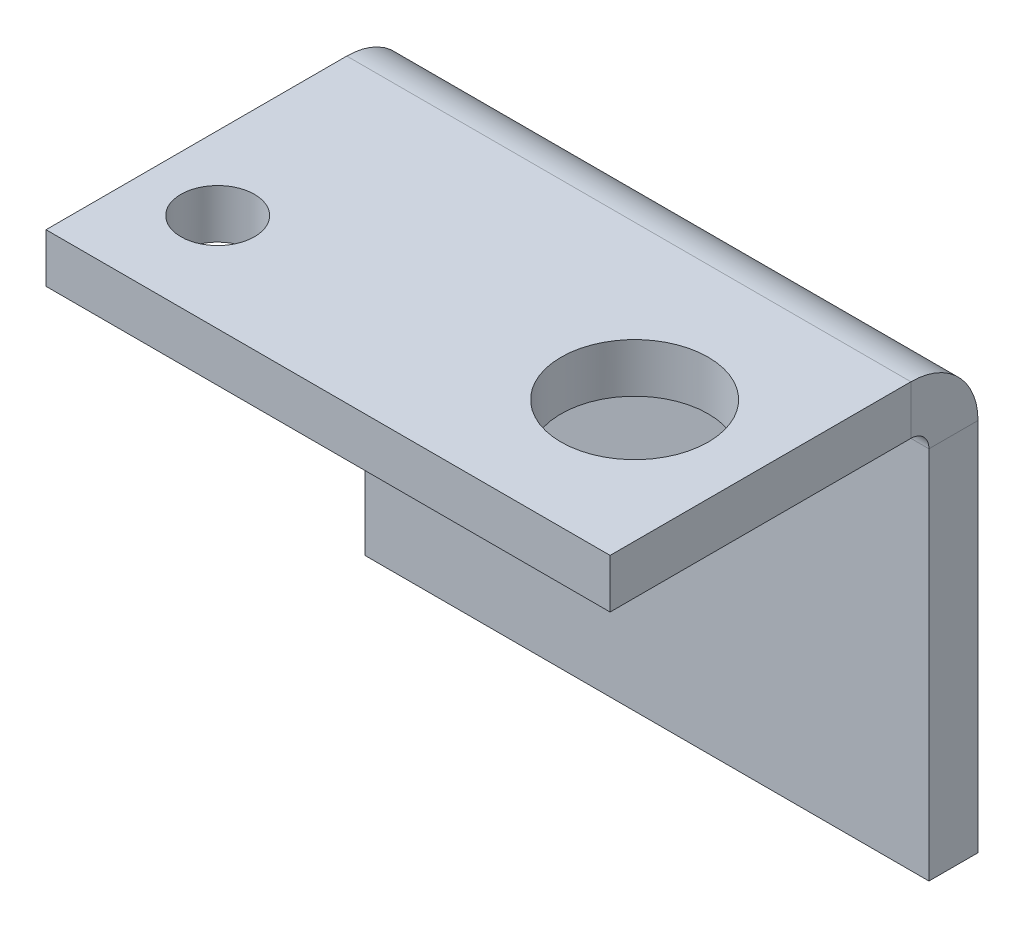
ISO-10303-21;
HEADER;
FILE_DESCRIPTION(('STEP AP214'),'2;1');
FILE_NAME('part.step','',(''),(''),'','','');
FILE_SCHEMA(('AUTOMOTIVE_DESIGN { 1 0 10303 214 1 1 1 1 }'));
ENDSEC;
DATA;
#1=APPLICATION_CONTEXT('core data for automotive mechanical design processes');
#2=APPLICATION_PROTOCOL_DEFINITION('international standard','automotive_design',2000,#1);
#3=PRODUCT_CONTEXT('',#1,'mechanical');
#4=PRODUCT('Part','Part','',(#3));
#5=PRODUCT_RELATED_PRODUCT_CATEGORY('part','',(#4));
#6=PRODUCT_DEFINITION_FORMATION('','',#4);
#7=PRODUCT_DEFINITION_CONTEXT('part definition',#1,'design');
#8=PRODUCT_DEFINITION('design','',#6,#7);
#9=PRODUCT_DEFINITION_SHAPE('','',#8);
#10=(LENGTH_UNIT() NAMED_UNIT(*) SI_UNIT(.MILLI.,.METRE.));
#11=(NAMED_UNIT(*) PLANE_ANGLE_UNIT() SI_UNIT($,.RADIAN.));
#12=(NAMED_UNIT(*) SI_UNIT($,.STERADIAN.) SOLID_ANGLE_UNIT());
#13=UNCERTAINTY_MEASURE_WITH_UNIT(LENGTH_MEASURE(1.E-05),#10,'distance_accuracy_value','');
#14=(GEOMETRIC_REPRESENTATION_CONTEXT(3) GLOBAL_UNCERTAINTY_ASSIGNED_CONTEXT((#13)) GLOBAL_UNIT_ASSIGNED_CONTEXT((#10,
#11,#12)) REPRESENTATION_CONTEXT('',''));
#15=CARTESIAN_POINT('',(0.,0.,0.));
#16=DIRECTION('',(0.,0.,1.));
#17=DIRECTION('',(1.,0.,0.));
#18=AXIS2_PLACEMENT_3D('',#15,#16,#17);
#19=CARTESIAN_POINT('',(25.,0.,0.));
#20=DIRECTION('',(1.,0.,0.));
#21=DIRECTION('',(0.,0.,-1.));
#22=AXIS2_PLACEMENT_3D('',#19,#20,#21);
#23=PLANE('',#22);
#24=DIRECTION('',(0.,1.,0.));
#25=VECTOR('',#24,1.);
#26=CARTESIAN_POINT('',(25.,0.,0.));
#27=LINE('',#26,#25);
#28=CARTESIAN_POINT('',(25.,-18.,0.));
#29=VERTEX_POINT('',#28);
#30=CARTESIAN_POINT('',(25.,-2.73659999999998,0.));
#31=VERTEX_POINT('',#30);
#32=EDGE_CURVE('E172',#29,#31,#27,.T.);
#33=ORIENTED_EDGE('',*,*,#32,.T.);
#34=DIRECTION('',(0.,0.,1.));
#35=VECTOR('',#34,1.);
#36=CARTESIAN_POINT('',(25.,-2.73659999999998,0.));
#37=LINE('',#36,#35);
#38=CARTESIAN_POINT('',(25.,-2.7366,2.));
#39=VERTEX_POINT('',#38);
#40=EDGE_CURVE('E13',#31,#39,#37,.T.);
#41=ORIENTED_EDGE('',*,*,#40,.T.);
#42=DIRECTION('',(0.,1.,0.));
#43=VECTOR('',#42,1.);
#44=CARTESIAN_POINT('',(25.,0.,2.00000000000001));
#45=LINE('',#44,#43);
#46=CARTESIAN_POINT('',(25.,-18.,1.99999999999994));
#47=VERTEX_POINT('',#46);
#48=EDGE_CURVE('E73',#47,#39,#45,.T.);
#49=ORIENTED_EDGE('',*,*,#48,.F.);
#50=DIRECTION('',(0.,0.,-1.));
#51=VECTOR('',#50,1.);
#52=CARTESIAN_POINT('',(25.,-18.,0.));
#53=LINE('',#52,#51);
#54=EDGE_CURVE('E170',#47,#29,#53,.T.);
#55=ORIENTED_EDGE('',*,*,#54,.T.);
#56=EDGE_LOOP('',(#33,#41,#49,#55));
#57=FACE_BOUND('',#56,.T.);
#58=ADVANCED_FACE('F59',(#57),#23,.T.);
#59=DIRECTION('',(0.,0.,-1.));
#60=VECTOR('',#59,1.);
#61=CARTESIAN_POINT('',(25.,-2.,15.));
#62=LINE('',#61,#60);
#63=CARTESIAN_POINT('',(25.,-2.,15.));
#64=VERTEX_POINT('',#63);
#65=CARTESIAN_POINT('',(25.,-2.,2.7366));
#66=VERTEX_POINT('',#65);
#67=EDGE_CURVE('E206',#64,#66,#62,.T.);
#68=ORIENTED_EDGE('',*,*,#67,.T.);
#69=DIRECTION('',(0.,1.,0.));
#70=VECTOR('',#69,1.);
#71=CARTESIAN_POINT('',(25.,-2.,2.7366));
#72=LINE('',#71,#70);
#73=CARTESIAN_POINT('',(25.,0.,2.7366));
#74=VERTEX_POINT('',#73);
#75=EDGE_CURVE('E67',#66,#74,#72,.T.);
#76=ORIENTED_EDGE('',*,*,#75,.T.);
#77=DIRECTION('',(0.,0.,1.));
#78=VECTOR('',#77,1.);
#79=CARTESIAN_POINT('',(25.,0.,15.));
#80=LINE('',#79,#78);
#81=CARTESIAN_POINT('',(25.,0.,15.));
#82=VERTEX_POINT('',#81);
#83=EDGE_CURVE('E124',#74,#82,#80,.T.);
#84=ORIENTED_EDGE('',*,*,#83,.T.);
#85=DIRECTION('',(0.,-1.,0.));
#86=VECTOR('',#85,1.);
#87=CARTESIAN_POINT('',(25.,0.,15.));
#88=LINE('',#87,#86);
#89=EDGE_CURVE('E128',#82,#64,#88,.T.);
#90=ORIENTED_EDGE('',*,*,#89,.T.);
#91=EDGE_LOOP('',(#68,#76,#84,#90));
#92=FACE_BOUND('',#91,.T.);
#93=ADVANCED_FACE('F127',(#92),#23,.T.);
#94=CARTESIAN_POINT('',(0.,-2.,15.));
#95=DIRECTION('',(0.,1.,0.));
#96=DIRECTION('',(0.,0.,1.));
#97=AXIS2_PLACEMENT_3D('',#94,#95,#96);
#98=PLANE('',#97);
#99=CARTESIAN_POINT('',(5.,-2.,11.));
#100=DIRECTION('',(0.,-1.,0.));
#101=DIRECTION('',(0.,0.,-1.));
#102=AXIS2_PLACEMENT_3D('',#99,#100,#101);
#103=CIRCLE('',#102,1.5);
#104=CARTESIAN_POINT('',(5.,-2.,9.5));
#105=VERTEX_POINT('',#104);
#106=EDGE_CURVE('E159',#105,#105,#103,.T.);
#107=ORIENTED_EDGE('',*,*,#106,.F.);
#108=EDGE_LOOP('',(#107));
#109=FACE_BOUND('',#108,.T.);
#110=CARTESIAN_POINT('',(20.,-2.,9.));
#111=DIRECTION('',(0.,-1.,0.));
#112=DIRECTION('',(0.,0.,-1.));
#113=AXIS2_PLACEMENT_3D('',#110,#111,#112);
#114=CIRCLE('',#113,3.);
#115=CARTESIAN_POINT('',(20.,-2.,6.));
#116=VERTEX_POINT('',#115);
#117=EDGE_CURVE('E163',#116,#116,#114,.T.);
#118=ORIENTED_EDGE('',*,*,#117,.F.);
#119=EDGE_LOOP('',(#118));
#120=FACE_BOUND('',#119,.T.);
#121=ORIENTED_EDGE('',*,*,#67,.F.);
#122=DIRECTION('',(1.,0.,0.));
#123=VECTOR('',#122,1.);
#124=CARTESIAN_POINT('',(0.,-2.,15.));
#125=LINE('',#124,#123);
#126=CARTESIAN_POINT('',(2.,-2.,15.));
#127=VERTEX_POINT('',#126);
#128=EDGE_CURVE('E142',#127,#64,#125,.T.);
#129=ORIENTED_EDGE('',*,*,#128,.F.);
#130=DIRECTION('',(0.,0.,-1.));
#131=VECTOR('',#130,1.);
#132=CARTESIAN_POINT('',(2.,-2.,15.));
#133=LINE('',#132,#131);
#134=CARTESIAN_POINT('',(2.,-2.,2.7366));
#135=VERTEX_POINT('',#134);
#136=EDGE_CURVE('E226',#127,#135,#133,.T.);
#137=ORIENTED_EDGE('',*,*,#136,.T.);
#138=DIRECTION('',(1.,0.,0.));
#139=VECTOR('',#138,1.);
#140=CARTESIAN_POINT('',(30.,-2.,2.7366));
#141=LINE('',#140,#139);
#142=EDGE_CURVE('E183',#66,#135,#141,.F.);
#143=ORIENTED_EDGE('',*,*,#142,.F.);
#144=EDGE_LOOP('',(#121,#129,#137,#143));
#145=FACE_BOUND('',#144,.T.);
#146=ADVANCED_FACE('F61',(#109,#120,#145),#98,.F.);
#147=CARTESIAN_POINT('',(0.,0.,15.));
#148=DIRECTION('',(0.,1.,0.));
#149=DIRECTION('',(0.,0.,1.));
#150=AXIS2_PLACEMENT_3D('',#147,#148,#149);
#151=PLANE('',#150);
#152=CARTESIAN_POINT('',(20.,0.,9.));
#153=DIRECTION('',(0.,1.,0.));
#154=DIRECTION('',(0.,0.,1.));
#155=AXIS2_PLACEMENT_3D('',#152,#153,#154);
#156=CIRCLE('',#155,3.);
#157=CARTESIAN_POINT('',(20.,0.,12.));
#158=VERTEX_POINT('',#157);
#159=EDGE_CURVE('E160',#158,#158,#156,.T.);
#160=ORIENTED_EDGE('',*,*,#159,.F.);
#161=EDGE_LOOP('',(#160));
#162=FACE_BOUND('',#161,.T.);
#163=CARTESIAN_POINT('',(5.,0.,11.));
#164=DIRECTION('',(0.,1.,0.));
#165=DIRECTION('',(0.,0.,1.));
#166=AXIS2_PLACEMENT_3D('',#163,#164,#165);
#167=CIRCLE('',#166,1.5);
#168=CARTESIAN_POINT('',(5.,0.,12.5));
#169=VERTEX_POINT('',#168);
#170=EDGE_CURVE('E153',#169,#169,#167,.T.);
#171=ORIENTED_EDGE('',*,*,#170,.F.);
#172=EDGE_LOOP('',(#171));
#173=FACE_BOUND('',#172,.T.);
#174=DIRECTION('',(1.,0.,0.));
#175=VECTOR('',#174,1.);
#176=CARTESIAN_POINT('',(0.,0.,15.));
#177=LINE('',#176,#175);
#178=CARTESIAN_POINT('',(2.,0.,15.));
#179=VERTEX_POINT('',#178);
#180=EDGE_CURVE('E140',#179,#82,#177,.T.);
#181=ORIENTED_EDGE('',*,*,#180,.T.);
#182=ORIENTED_EDGE('',*,*,#83,.F.);
#183=DIRECTION('',(1.,0.,0.));
#184=VECTOR('',#183,1.);
#185=CARTESIAN_POINT('',(30.,0.,2.7366));
#186=LINE('',#185,#184);
#187=CARTESIAN_POINT('',(2.,0.,2.7366));
#188=VERTEX_POINT('',#187);
#189=EDGE_CURVE('E186',#74,#188,#186,.F.);
#190=ORIENTED_EDGE('',*,*,#189,.T.);
#191=DIRECTION('',(0.,0.,-1.));
#192=VECTOR('',#191,1.);
#193=CARTESIAN_POINT('',(2.,0.,15.));
#194=LINE('',#193,#192);
#195=EDGE_CURVE('E147',#179,#188,#194,.T.);
#196=ORIENTED_EDGE('',*,*,#195,.F.);
#197=EDGE_LOOP('',(#181,#182,#190,#196));
#198=FACE_BOUND('',#197,.T.);
#199=ADVANCED_FACE('F145',(#162,#173,#198),#151,.T.);
#200=CARTESIAN_POINT('',(0.,0.,15.));
#201=DIRECTION('',(0.,0.,-1.));
#202=DIRECTION('',(-1.,0.,0.));
#203=AXIS2_PLACEMENT_3D('',#200,#201,#202);
#204=PLANE('',#203);
#205=ORIENTED_EDGE('',*,*,#89,.F.);
#206=ORIENTED_EDGE('',*,*,#180,.F.);
#207=DIRECTION('',(0.,-1.,0.));
#208=VECTOR('',#207,1.);
#209=CARTESIAN_POINT('',(2.,0.,15.));
#210=LINE('',#209,#208);
#211=EDGE_CURVE('E228',#179,#127,#210,.T.);
#212=ORIENTED_EDGE('',*,*,#211,.T.);
#213=ORIENTED_EDGE('',*,*,#128,.T.);
#214=EDGE_LOOP('',(#205,#206,#212,#213));
#215=FACE_BOUND('',#214,.T.);
#216=ADVANCED_FACE('F138',(#215),#204,.F.);
#217=CARTESIAN_POINT('',(30.,-2.7366,2.7366));
#218=DIRECTION('',(1.,0.,0.));
#219=DIRECTION('',(0.,0.,-1.));
#220=AXIS2_PLACEMENT_3D('',#217,#218,#219);
#221=CYLINDRICAL_SURFACE('',#220,2.7366);
#222=ORIENTED_EDGE('',*,*,#189,.F.);
#223=CARTESIAN_POINT('',(25.,-2.7366,2.7366));
#224=DIRECTION('',(1.,0.,0.));
#225=DIRECTION('',(0.,0.,-1.));
#226=AXIS2_PLACEMENT_3D('',#223,#224,#225);
#227=CIRCLE('',#226,2.7366);
#228=EDGE_CURVE('E210',#74,#31,#227,.F.);
#229=ORIENTED_EDGE('',*,*,#228,.T.);
#230=DIRECTION('',(1.,0.,0.));
#231=VECTOR('',#230,1.);
#232=CARTESIAN_POINT('',(0.,-2.73659999999998,0.));
#233=LINE('',#232,#231);
#234=CARTESIAN_POINT('',(2.,-2.73659999999998,0.));
#235=VERTEX_POINT('',#234);
#236=EDGE_CURVE('E178',#31,#235,#233,.F.);
#237=ORIENTED_EDGE('',*,*,#236,.T.);
#238=CARTESIAN_POINT('',(2.,-2.7366,2.7366));
#239=DIRECTION('',(1.,0.,0.));
#240=DIRECTION('',(0.,0.,-1.));
#241=AXIS2_PLACEMENT_3D('',#238,#239,#240);
#242=CIRCLE('',#241,2.7366);
#243=EDGE_CURVE('E222',#188,#235,#242,.F.);
#244=ORIENTED_EDGE('',*,*,#243,.F.);
#245=EDGE_LOOP('',(#222,#229,#237,#244));
#246=FACE_BOUND('',#245,.T.);
#247=ADVANCED_FACE('F248',(#246),#221,.T.);
#248=CARTESIAN_POINT('',(30.,-2.7366,2.7366));
#249=DIRECTION('',(1.,0.,0.));
#250=DIRECTION('',(0.,0.,-1.));
#251=AXIS2_PLACEMENT_3D('',#248,#249,#250);
#252=CYLINDRICAL_SURFACE('',#251,0.7366);
#253=CARTESIAN_POINT('',(25.,-2.7366,2.7366));
#254=DIRECTION('',(1.,0.,0.));
#255=DIRECTION('',(0.,0.,-1.));
#256=AXIS2_PLACEMENT_3D('',#253,#254,#255);
#257=CIRCLE('',#256,0.7366);
#258=EDGE_CURVE('E179',#66,#39,#257,.F.);
#259=ORIENTED_EDGE('',*,*,#258,.F.);
#260=ORIENTED_EDGE('',*,*,#142,.T.);
#261=CARTESIAN_POINT('',(2.,-2.7366,2.7366));
#262=DIRECTION('',(1.,0.,0.));
#263=DIRECTION('',(0.,0.,-1.));
#264=AXIS2_PLACEMENT_3D('',#261,#262,#263);
#265=CIRCLE('',#264,0.7366);
#266=CARTESIAN_POINT('',(2.,-2.7366,2.));
#267=VERTEX_POINT('',#266);
#268=EDGE_CURVE('E219',#135,#267,#265,.F.);
#269=ORIENTED_EDGE('',*,*,#268,.T.);
#270=DIRECTION('',(1.,0.,0.));
#271=VECTOR('',#270,1.);
#272=CARTESIAN_POINT('',(0.,-2.7366,2.));
#273=LINE('',#272,#271);
#274=EDGE_CURVE('E162',#267,#39,#273,.T.);
#275=ORIENTED_EDGE('',*,*,#274,.T.);
#276=EDGE_LOOP('',(#259,#260,#269,#275));
#277=FACE_BOUND('',#276,.T.);
#278=ADVANCED_FACE('F240',(#277),#252,.F.);
#279=CARTESIAN_POINT('',(0.,0.,0.));
#280=DIRECTION('',(0.,0.,1.));
#281=DIRECTION('',(0.,-1.,0.));
#282=AXIS2_PLACEMENT_3D('',#279,#280,#281);
#283=PLANE('',#282);
#284=CARTESIAN_POINT('',(8.,-12.,0.));
#285=DIRECTION('',(0.,0.,-1.));
#286=DIRECTION('',(0.,1.,0.));
#287=AXIS2_PLACEMENT_3D('',#284,#285,#286);
#288=CIRCLE('',#287,3.05);
#289=CARTESIAN_POINT('',(8.,-8.95,0.));
#290=VERTEX_POINT('',#289);
#291=EDGE_CURVE('E230',#290,#290,#288,.T.);
#292=ORIENTED_EDGE('',*,*,#291,.F.);
#293=EDGE_LOOP('',(#292));
#294=FACE_BOUND('',#293,.T.);
#295=ORIENTED_EDGE('',*,*,#32,.F.);
#296=DIRECTION('',(-1.,0.,0.));
#297=VECTOR('',#296,1.);
#298=CARTESIAN_POINT('',(0.,-18.,0.));
#299=LINE('',#298,#297);
#300=CARTESIAN_POINT('',(2.,-18.,0.));
#301=VERTEX_POINT('',#300);
#302=EDGE_CURVE('E81',#29,#301,#299,.T.);
#303=ORIENTED_EDGE('',*,*,#302,.T.);
#304=DIRECTION('',(0.,1.,0.));
#305=VECTOR('',#304,1.);
#306=CARTESIAN_POINT('',(2.,0.,0.));
#307=LINE('',#306,#305);
#308=EDGE_CURVE('E213',#301,#235,#307,.T.);
#309=ORIENTED_EDGE('',*,*,#308,.T.);
#310=ORIENTED_EDGE('',*,*,#236,.F.);
#311=EDGE_LOOP('',(#295,#303,#309,#310));
#312=FACE_BOUND('',#311,.T.);
#313=ADVANCED_FACE('F177',(#294,#312),#283,.F.);
#314=CARTESIAN_POINT('',(0.,0.,2.00000000000001));
#315=DIRECTION('',(0.,0.,1.));
#316=DIRECTION('',(0.,-1.,0.));
#317=AXIS2_PLACEMENT_3D('',#314,#315,#316);
#318=PLANE('',#317);
#319=DIRECTION('',(1.,0.,0.));
#320=VECTOR('',#319,1.);
#321=CARTESIAN_POINT('',(0.,-18.,1.99999999999994));
#322=LINE('',#321,#320);
#323=CARTESIAN_POINT('',(2.,-18.,1.99999999999994));
#324=VERTEX_POINT('',#323);
#325=EDGE_CURVE('E184',#47,#324,#322,.F.);
#326=ORIENTED_EDGE('',*,*,#325,.F.);
#327=ORIENTED_EDGE('',*,*,#48,.T.);
#328=ORIENTED_EDGE('',*,*,#274,.F.);
#329=DIRECTION('',(0.,1.,0.));
#330=VECTOR('',#329,1.);
#331=CARTESIAN_POINT('',(2.,0.,2.00000000000001));
#332=LINE('',#331,#330);
#333=EDGE_CURVE('E209',#324,#267,#332,.T.);
#334=ORIENTED_EDGE('',*,*,#333,.F.);
#335=EDGE_LOOP('',(#326,#327,#328,#334));
#336=FACE_BOUND('',#335,.T.);
#337=ADVANCED_FACE('F239',(#336),#318,.T.);
#338=CARTESIAN_POINT('',(0.,-18.,0.));
#339=DIRECTION('',(0.,1.,0.));
#340=DIRECTION('',(0.,0.,1.));
#341=AXIS2_PLACEMENT_3D('',#338,#339,#340);
#342=PLANE('',#341);
#343=ORIENTED_EDGE('',*,*,#54,.F.);
#344=ORIENTED_EDGE('',*,*,#325,.T.);
#345=DIRECTION('',(0.,0.,-1.));
#346=VECTOR('',#345,1.);
#347=CARTESIAN_POINT('',(2.,-18.,0.));
#348=LINE('',#347,#346);
#349=EDGE_CURVE('E148',#324,#301,#348,.T.);
#350=ORIENTED_EDGE('',*,*,#349,.T.);
#351=ORIENTED_EDGE('',*,*,#302,.F.);
#352=EDGE_LOOP('',(#343,#344,#350,#351));
#353=FACE_BOUND('',#352,.T.);
#354=ADVANCED_FACE('F181',(#353),#342,.F.);
#355=CARTESIAN_POINT('',(2.,0.,0.));
#356=DIRECTION('',(1.,0.,0.));
#357=DIRECTION('',(0.,0.,-1.));
#358=AXIS2_PLACEMENT_3D('',#355,#356,#357);
#359=PLANE('',#358);
#360=ORIENTED_EDGE('',*,*,#333,.T.);
#361=DIRECTION('',(0.,0.,-1.));
#362=VECTOR('',#361,1.);
#363=CARTESIAN_POINT('',(2.,-2.7366,2.));
#364=LINE('',#363,#362);
#365=EDGE_CURVE('E167',#267,#235,#364,.T.);
#366=ORIENTED_EDGE('',*,*,#365,.T.);
#367=ORIENTED_EDGE('',*,*,#308,.F.);
#368=ORIENTED_EDGE('',*,*,#349,.F.);
#369=EDGE_LOOP('',(#360,#366,#367,#368));
#370=FACE_BOUND('',#369,.T.);
#371=ADVANCED_FACE('F268',(#370),#359,.F.);
#372=ORIENTED_EDGE('',*,*,#195,.T.);
#373=DIRECTION('',(0.,-1.,0.));
#374=VECTOR('',#373,1.);
#375=CARTESIAN_POINT('',(2.,0.,2.7366));
#376=LINE('',#375,#374);
#377=EDGE_CURVE('E151',#188,#135,#376,.T.);
#378=ORIENTED_EDGE('',*,*,#377,.T.);
#379=ORIENTED_EDGE('',*,*,#136,.F.);
#380=ORIENTED_EDGE('',*,*,#211,.F.);
#381=EDGE_LOOP('',(#372,#378,#379,#380));
#382=FACE_BOUND('',#381,.T.);
#383=ADVANCED_FACE('F269',(#382),#359,.F.);
#384=CARTESIAN_POINT('',(5.,8.,11.));
#385=DIRECTION('',(0.,-1.,0.));
#386=DIRECTION('',(0.,0.,-1.));
#387=AXIS2_PLACEMENT_3D('',#384,#385,#386);
#388=CYLINDRICAL_SURFACE('',#387,1.5);
#389=ORIENTED_EDGE('',*,*,#170,.T.);
#390=EDGE_LOOP('',(#389));
#391=FACE_BOUND('',#390,.T.);
#392=ORIENTED_EDGE('',*,*,#106,.T.);
#393=EDGE_LOOP('',(#392));
#394=FACE_BOUND('',#393,.T.);
#395=ADVANCED_FACE('F198',(#391,#394),#388,.F.);
#396=CARTESIAN_POINT('',(20.,8.,9.));
#397=DIRECTION('',(0.,-1.,0.));
#398=DIRECTION('',(0.,0.,-1.));
#399=AXIS2_PLACEMENT_3D('',#396,#397,#398);
#400=CYLINDRICAL_SURFACE('',#399,3.);
#401=ORIENTED_EDGE('',*,*,#159,.T.);
#402=EDGE_LOOP('',(#401));
#403=FACE_BOUND('',#402,.T.);
#404=ORIENTED_EDGE('',*,*,#117,.T.);
#405=EDGE_LOOP('',(#404));
#406=FACE_BOUND('',#405,.T.);
#407=ADVANCED_FACE('F291',(#403,#406),#400,.F.);
#408=CARTESIAN_POINT('',(8.,-12.,0.999999999999958));
#409=DIRECTION('',(0.,0.,-1.));
#410=DIRECTION('',(0.,1.,0.));
#411=AXIS2_PLACEMENT_3D('',#408,#409,#410);
#412=CYLINDRICAL_SURFACE('',#411,3.05);
#413=CARTESIAN_POINT('',(8.,-12.,0.999999999999958));
#414=DIRECTION('',(0.,0.,-1.));
#415=DIRECTION('',(0.,1.,0.));
#416=AXIS2_PLACEMENT_3D('',#413,#414,#415);
#417=CIRCLE('',#416,3.05);
#418=CARTESIAN_POINT('',(8.,-8.95000000000001,0.999999999999969));
#419=VERTEX_POINT('',#418);
#420=EDGE_CURVE('E231',#419,#419,#417,.T.);
#421=ORIENTED_EDGE('',*,*,#420,.F.);
#422=EDGE_LOOP('',(#421));
#423=FACE_BOUND('',#422,.T.);
#424=ORIENTED_EDGE('',*,*,#291,.T.);
#425=EDGE_LOOP('',(#424));
#426=FACE_BOUND('',#425,.T.);
#427=ADVANCED_FACE('F236',(#423,#426),#412,.F.);
#428=CARTESIAN_POINT('',(8.,-12.,0.999999999999958));
#429=DIRECTION('',(0.,0.,-1.));
#430=DIRECTION('',(0.,1.,0.));
#431=AXIS2_PLACEMENT_3D('',#428,#429,#430);
#432=PLANE('',#431);
#433=ORIENTED_EDGE('',*,*,#420,.T.);
#434=EDGE_LOOP('',(#433));
#435=FACE_BOUND('',#434,.T.);
#436=ADVANCED_FACE('F266',(#435),#432,.T.);
#437=ORIENTED_EDGE('',*,*,#365,.F.);
#438=ORIENTED_EDGE('',*,*,#268,.F.);
#439=ORIENTED_EDGE('',*,*,#377,.F.);
#440=ORIENTED_EDGE('',*,*,#243,.T.);
#441=EDGE_LOOP('',(#437,#438,#439,#440));
#442=FACE_BOUND('',#441,.T.);
#443=ADVANCED_FACE('F261',(#442),#359,.F.);
#444=ORIENTED_EDGE('',*,*,#40,.F.);
#445=ORIENTED_EDGE('',*,*,#228,.F.);
#446=ORIENTED_EDGE('',*,*,#75,.F.);
#447=ORIENTED_EDGE('',*,*,#258,.T.);
#448=EDGE_LOOP('',(#444,#445,#446,#447));
#449=FACE_BOUND('',#448,.T.);
#450=ADVANCED_FACE('F254',(#449),#23,.T.);
#451=CLOSED_SHELL('',(#58,#93,#146,#199,#216,#247,#278,#313,#337,#354,#371,#383,#395,#407,#427,
#436,#443,#450));
#452=MANIFOLD_SOLID_BREP('B2',#451);
#453=ADVANCED_BREP_SHAPE_REPRESENTATION('',(#18,#452),#14);
#454=SHAPE_DEFINITION_REPRESENTATION(#9,#453);
ENDSEC;
END-ISO-10303-21;
